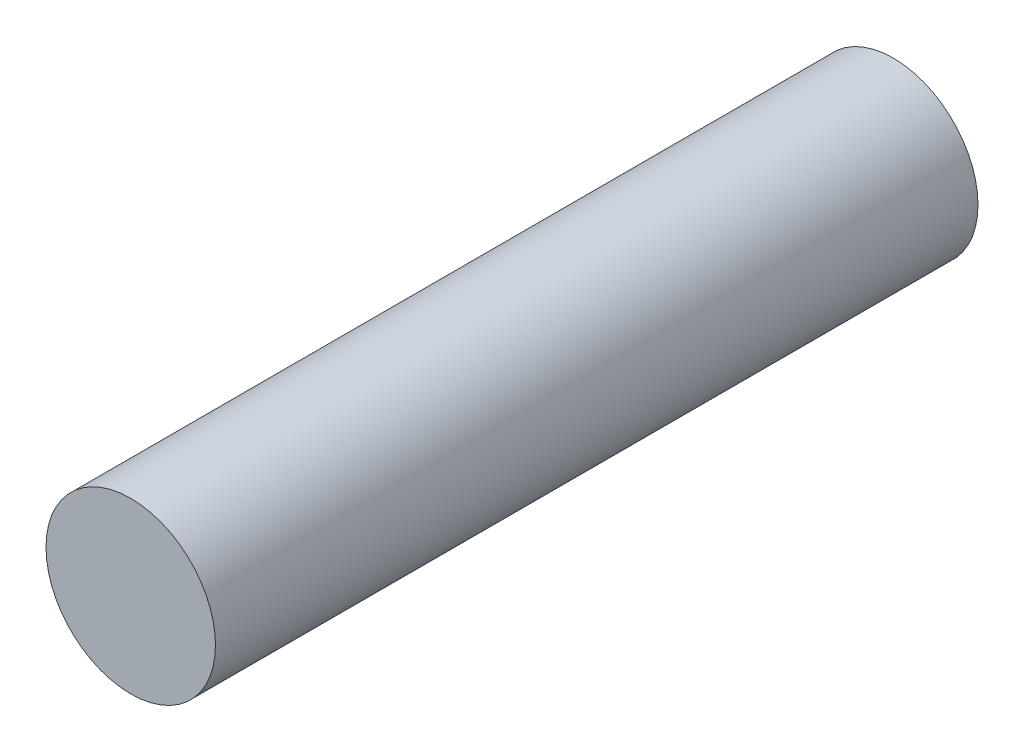
ISO-10303-21;
HEADER;
FILE_DESCRIPTION(('STEP AP214'),'2;1');
FILE_NAME('part.step','',(''),(''),'','','');
FILE_SCHEMA(('AUTOMOTIVE_DESIGN { 1 0 10303 214 1 1 1 1 }'));
ENDSEC;
DATA;
#1=APPLICATION_CONTEXT('core data for automotive mechanical design processes');
#2=APPLICATION_PROTOCOL_DEFINITION('international standard','automotive_design',2000,#1);
#3=PRODUCT_CONTEXT('',#1,'mechanical');
#4=PRODUCT('Part','Part','',(#3));
#5=PRODUCT_RELATED_PRODUCT_CATEGORY('part','',(#4));
#6=PRODUCT_DEFINITION_FORMATION('','',#4);
#7=PRODUCT_DEFINITION_CONTEXT('part definition',#1,'design');
#8=PRODUCT_DEFINITION('design','',#6,#7);
#9=PRODUCT_DEFINITION_SHAPE('','',#8);
#10=(LENGTH_UNIT() NAMED_UNIT(*) SI_UNIT(.MILLI.,.METRE.));
#11=(NAMED_UNIT(*) PLANE_ANGLE_UNIT() SI_UNIT($,.RADIAN.));
#12=(NAMED_UNIT(*) SI_UNIT($,.STERADIAN.) SOLID_ANGLE_UNIT());
#13=UNCERTAINTY_MEASURE_WITH_UNIT(LENGTH_MEASURE(1.E-05),#10,'distance_accuracy_value','');
#14=(GEOMETRIC_REPRESENTATION_CONTEXT(3) GLOBAL_UNCERTAINTY_ASSIGNED_CONTEXT((#13)) GLOBAL_UNIT_ASSIGNED_CONTEXT((#10,
#11,#12)) REPRESENTATION_CONTEXT('',''));
#15=CARTESIAN_POINT('',(0.,0.,0.));
#16=DIRECTION('',(0.,0.,1.));
#17=DIRECTION('',(1.,0.,0.));
#18=AXIS2_PLACEMENT_3D('',#15,#16,#17);
#19=CARTESIAN_POINT('',(0.,0.,45.));
#20=DIRECTION('',(0.,0.,-1.));
#21=DIRECTION('',(-1.,0.,0.));
#22=AXIS2_PLACEMENT_3D('',#19,#20,#21);
#23=CYLINDRICAL_SURFACE('',#22,5.);
#24=CARTESIAN_POINT('',(0.,0.,45.));
#25=DIRECTION('',(0.,0.,1.));
#26=DIRECTION('',(1.,0.,0.));
#27=AXIS2_PLACEMENT_3D('',#24,#25,#26);
#28=CIRCLE('',#27,5.);
#29=CARTESIAN_POINT('',(5.,0.,45.));
#30=VERTEX_POINT('',#29);
#31=EDGE_CURVE('E10',#30,#30,#28,.T.);
#32=ORIENTED_EDGE('',*,*,#31,.F.);
#33=EDGE_LOOP('',(#32));
#34=FACE_BOUND('',#33,.T.);
#35=CARTESIAN_POINT('',(0.,0.,0.));
#36=DIRECTION('',(0.,0.,1.));
#37=DIRECTION('',(1.,0.,0.));
#38=AXIS2_PLACEMENT_3D('',#35,#36,#37);
#39=CIRCLE('',#38,5.);
#40=CARTESIAN_POINT('',(5.,0.,0.));
#41=VERTEX_POINT('',#40);
#42=EDGE_CURVE('E40',#41,#41,#39,.T.);
#43=ORIENTED_EDGE('',*,*,#42,.T.);
#44=EDGE_LOOP('',(#43));
#45=FACE_BOUND('',#44,.T.);
#46=ADVANCED_FACE('F34',(#34,#45),#23,.T.);
#47=CARTESIAN_POINT('',(0.,0.,45.));
#48=DIRECTION('',(0.,0.,1.));
#49=DIRECTION('',(1.,0.,0.));
#50=AXIS2_PLACEMENT_3D('',#47,#48,#49);
#51=PLANE('',#50);
#52=ORIENTED_EDGE('',*,*,#31,.T.);
#53=EDGE_LOOP('',(#52));
#54=FACE_BOUND('',#53,.T.);
#55=ADVANCED_FACE('F49',(#54),#51,.T.);
#56=CARTESIAN_POINT('',(0.,0.,0.));
#57=DIRECTION('',(0.,0.,1.));
#58=DIRECTION('',(1.,0.,0.));
#59=AXIS2_PLACEMENT_3D('',#56,#57,#58);
#60=PLANE('',#59);
#61=ORIENTED_EDGE('',*,*,#42,.F.);
#62=EDGE_LOOP('',(#61));
#63=FACE_BOUND('',#62,.T.);
#64=ADVANCED_FACE('F47',(#63),#60,.F.);
#65=CLOSED_SHELL('',(#46,#55,#64));
#66=MANIFOLD_SOLID_BREP('B2',#65);
#67=ADVANCED_BREP_SHAPE_REPRESENTATION('',(#18,#66),#14);
#68=SHAPE_DEFINITION_REPRESENTATION(#9,#67);
ENDSEC;
END-ISO-10303-21;
